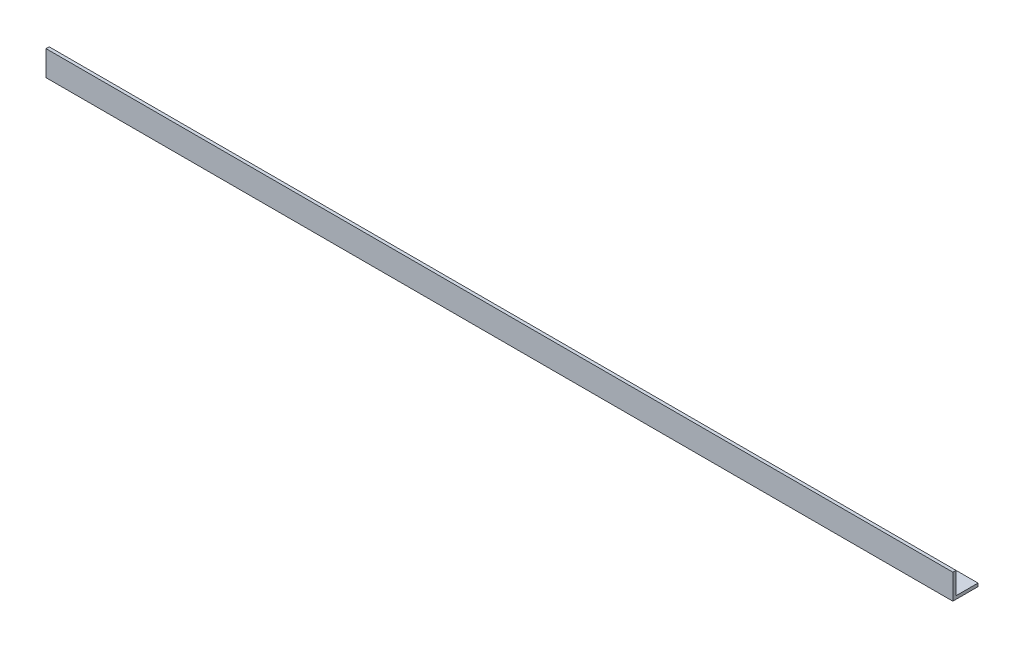
ISO-10303-21;
HEADER;
FILE_DESCRIPTION(('STEP AP214'),'2;1');
FILE_NAME('part.step','',(''),(''),'','','');
FILE_SCHEMA(('AUTOMOTIVE_DESIGN { 1 0 10303 214 1 1 1 1 }'));
ENDSEC;
DATA;
#1=APPLICATION_CONTEXT('core data for automotive mechanical design processes');
#2=APPLICATION_PROTOCOL_DEFINITION('international standard','automotive_design',2000,#1);
#3=PRODUCT_CONTEXT('',#1,'mechanical');
#4=PRODUCT('Part','Part','',(#3));
#5=PRODUCT_RELATED_PRODUCT_CATEGORY('part','',(#4));
#6=PRODUCT_DEFINITION_FORMATION('','',#4);
#7=PRODUCT_DEFINITION_CONTEXT('part definition',#1,'design');
#8=PRODUCT_DEFINITION('design','',#6,#7);
#9=PRODUCT_DEFINITION_SHAPE('','',#8);
#10=(LENGTH_UNIT() NAMED_UNIT(*) SI_UNIT(.MILLI.,.METRE.));
#11=(NAMED_UNIT(*) PLANE_ANGLE_UNIT() SI_UNIT($,.RADIAN.));
#12=(NAMED_UNIT(*) SI_UNIT($,.STERADIAN.) SOLID_ANGLE_UNIT());
#13=UNCERTAINTY_MEASURE_WITH_UNIT(LENGTH_MEASURE(1.E-05),#10,'distance_accuracy_value','');
#14=(GEOMETRIC_REPRESENTATION_CONTEXT(3) GLOBAL_UNCERTAINTY_ASSIGNED_CONTEXT((#13)) GLOBAL_UNIT_ASSIGNED_CONTEXT((#10,
#11,#12)) REPRESENTATION_CONTEXT('',''));
#15=CARTESIAN_POINT('',(0.,0.,0.));
#16=DIRECTION('',(0.,0.,1.));
#17=DIRECTION('',(1.,0.,0.));
#18=AXIS2_PLACEMENT_3D('',#15,#16,#17);
#19=CARTESIAN_POINT('',(457.2,0.,-25.4000000000001));
#20=DIRECTION('',(0.,1.,0.));
#21=DIRECTION('',(0.,0.,1.));
#22=AXIS2_PLACEMENT_3D('',#19,#20,#21);
#23=PLANE('',#22);
#24=DIRECTION('',(0.,0.,-1.));
#25=VECTOR('',#24,1.);
#26=CARTESIAN_POINT('',(-457.2,0.,-25.3999999999999));
#27=LINE('',#26,#25);
#28=CARTESIAN_POINT('',(-457.2,0.,0.));
#29=VERTEX_POINT('',#28);
#30=CARTESIAN_POINT('',(-457.2,0.,-25.3999999999999));
#31=VERTEX_POINT('',#30);
#32=EDGE_CURVE('E140',#29,#31,#27,.T.);
#33=ORIENTED_EDGE('',*,*,#32,.T.);
#34=DIRECTION('',(-1.,0.,0.));
#35=VECTOR('',#34,1.);
#36=CARTESIAN_POINT('',(457.2,0.,-25.4000000000001));
#37=LINE('',#36,#35);
#38=CARTESIAN_POINT('',(457.2,0.,-25.4000000000001));
#39=VERTEX_POINT('',#38);
#40=EDGE_CURVE('E11',#39,#31,#37,.T.);
#41=ORIENTED_EDGE('',*,*,#40,.F.);
#42=DIRECTION('',(0.,0.,-1.));
#43=VECTOR('',#42,1.);
#44=CARTESIAN_POINT('',(457.2,0.,-25.4000000000001));
#45=LINE('',#44,#43);
#46=CARTESIAN_POINT('',(457.2,0.,0.));
#47=VERTEX_POINT('',#46);
#48=EDGE_CURVE('E156',#47,#39,#45,.T.);
#49=ORIENTED_EDGE('',*,*,#48,.F.);
#50=DIRECTION('',(-1.,0.,0.));
#51=VECTOR('',#50,1.);
#52=CARTESIAN_POINT('',(457.2,0.,0.));
#53=LINE('',#52,#51);
#54=EDGE_CURVE('E136',#47,#29,#53,.T.);
#55=ORIENTED_EDGE('',*,*,#54,.T.);
#56=EDGE_LOOP('',(#33,#41,#49,#55));
#57=FACE_BOUND('',#56,.T.);
#58=ADVANCED_FACE('F44',(#57),#23,.F.);
#59=CARTESIAN_POINT('',(457.2,3.17500000000015,-25.4000000000001));
#60=DIRECTION('',(0.,0.,1.));
#61=DIRECTION('',(1.,0.,0.));
#62=AXIS2_PLACEMENT_3D('',#59,#60,#61);
#63=PLANE('',#62);
#64=DIRECTION('',(0.,1.,0.));
#65=VECTOR('',#64,1.);
#66=CARTESIAN_POINT('',(-457.2,3.17500000000015,-25.3999999999999));
#67=LINE('',#66,#65);
#68=CARTESIAN_POINT('',(-457.2,3.17500000000015,-25.3999999999999));
#69=VERTEX_POINT('',#68);
#70=EDGE_CURVE('E144',#31,#69,#67,.T.);
#71=ORIENTED_EDGE('',*,*,#70,.T.);
#72=DIRECTION('',(-1.,0.,0.));
#73=VECTOR('',#72,1.);
#74=CARTESIAN_POINT('',(457.2,3.17500000000015,-25.4000000000001));
#75=LINE('',#74,#73);
#76=CARTESIAN_POINT('',(457.2,3.17500000000015,-25.4000000000001));
#77=VERTEX_POINT('',#76);
#78=EDGE_CURVE('E53',#77,#69,#75,.T.);
#79=ORIENTED_EDGE('',*,*,#78,.F.);
#80=DIRECTION('',(0.,1.,0.));
#81=VECTOR('',#80,1.);
#82=CARTESIAN_POINT('',(457.2,3.17500000000015,-25.4000000000001));
#83=LINE('',#82,#81);
#84=EDGE_CURVE('E104',#39,#77,#83,.T.);
#85=ORIENTED_EDGE('',*,*,#84,.F.);
#86=ORIENTED_EDGE('',*,*,#40,.T.);
#87=EDGE_LOOP('',(#71,#79,#85,#86));
#88=FACE_BOUND('',#87,.T.);
#89=ADVANCED_FACE('F185',(#88),#63,.F.);
#90=CARTESIAN_POINT('',(457.200000000001,3.17500000000015,-3.17500000000015));
#91=DIRECTION('',(0.,-1.,0.));
#92=DIRECTION('',(0.,0.,-1.));
#93=AXIS2_PLACEMENT_3D('',#90,#91,#92);
#94=PLANE('',#93);
#95=DIRECTION('',(0.,0.,1.));
#96=VECTOR('',#95,1.);
#97=CARTESIAN_POINT('',(-457.199999999999,3.17500000000015,-3.17499999999993));
#98=LINE('',#97,#96);
#99=CARTESIAN_POINT('',(-457.199999999999,3.17500000000015,-3.17499999999993));
#100=VERTEX_POINT('',#99);
#101=EDGE_CURVE('E147',#69,#100,#98,.T.);
#102=ORIENTED_EDGE('',*,*,#101,.T.);
#103=DIRECTION('',(-1.,0.,0.));
#104=VECTOR('',#103,1.);
#105=CARTESIAN_POINT('',(457.200000000001,3.17500000000015,-3.17500000000015));
#106=LINE('',#105,#104);
#107=CARTESIAN_POINT('',(457.200000000001,3.17500000000015,-3.17500000000015));
#108=VERTEX_POINT('',#107);
#109=EDGE_CURVE('E128',#108,#100,#106,.T.);
#110=ORIENTED_EDGE('',*,*,#109,.F.);
#111=DIRECTION('',(0.,0.,1.));
#112=VECTOR('',#111,1.);
#113=CARTESIAN_POINT('',(457.200000000001,3.17500000000015,-3.17500000000015));
#114=LINE('',#113,#112);
#115=EDGE_CURVE('E117',#77,#108,#114,.T.);
#116=ORIENTED_EDGE('',*,*,#115,.F.);
#117=ORIENTED_EDGE('',*,*,#78,.T.);
#118=EDGE_LOOP('',(#102,#110,#116,#117));
#119=FACE_BOUND('',#118,.T.);
#120=ADVANCED_FACE('F167',(#119),#94,.F.);
#121=CARTESIAN_POINT('',(457.200000000001,25.3999999999999,-3.17500000000015));
#122=DIRECTION('',(0.,0.,1.));
#123=DIRECTION('',(0.,-1.,0.));
#124=AXIS2_PLACEMENT_3D('',#121,#122,#123);
#125=PLANE('',#124);
#126=DIRECTION('',(0.,1.,0.));
#127=VECTOR('',#126,1.);
#128=CARTESIAN_POINT('',(-457.199999999999,25.3999999999999,-3.17499999999993));
#129=LINE('',#128,#127);
#130=CARTESIAN_POINT('',(-457.199999999999,25.3999999999999,-3.17499999999993));
#131=VERTEX_POINT('',#130);
#132=EDGE_CURVE('E126',#100,#131,#129,.T.);
#133=ORIENTED_EDGE('',*,*,#132,.T.);
#134=DIRECTION('',(-1.,0.,0.));
#135=VECTOR('',#134,1.);
#136=CARTESIAN_POINT('',(457.200000000001,25.3999999999999,-3.17500000000015));
#137=LINE('',#136,#135);
#138=CARTESIAN_POINT('',(457.200000000001,25.3999999999999,-3.17500000000015));
#139=VERTEX_POINT('',#138);
#140=EDGE_CURVE('E123',#139,#131,#137,.T.);
#141=ORIENTED_EDGE('',*,*,#140,.F.);
#142=DIRECTION('',(0.,1.,0.));
#143=VECTOR('',#142,1.);
#144=CARTESIAN_POINT('',(457.200000000001,25.3999999999999,-3.17500000000015));
#145=LINE('',#144,#143);
#146=EDGE_CURVE('E111',#108,#139,#145,.T.);
#147=ORIENTED_EDGE('',*,*,#146,.F.);
#148=ORIENTED_EDGE('',*,*,#109,.T.);
#149=EDGE_LOOP('',(#133,#141,#147,#148));
#150=FACE_BOUND('',#149,.T.);
#151=ADVANCED_FACE('F124',(#150),#125,.F.);
#152=CARTESIAN_POINT('',(457.2,25.3999999999999,0.));
#153=DIRECTION('',(0.,-1.,0.));
#154=DIRECTION('',(0.,0.,-1.));
#155=AXIS2_PLACEMENT_3D('',#152,#153,#154);
#156=PLANE('',#155);
#157=DIRECTION('',(0.,0.,1.));
#158=VECTOR('',#157,1.);
#159=CARTESIAN_POINT('',(-457.2,25.3999999999999,0.));
#160=LINE('',#159,#158);
#161=CARTESIAN_POINT('',(-457.2,25.3999999999999,0.));
#162=VERTEX_POINT('',#161);
#163=EDGE_CURVE('E89',#131,#162,#160,.T.);
#164=ORIENTED_EDGE('',*,*,#163,.T.);
#165=DIRECTION('',(-1.,0.,0.));
#166=VECTOR('',#165,1.);
#167=CARTESIAN_POINT('',(457.2,25.3999999999999,0.));
#168=LINE('',#167,#166);
#169=CARTESIAN_POINT('',(457.2,25.3999999999999,0.));
#170=VERTEX_POINT('',#169);
#171=EDGE_CURVE('E129',#170,#162,#168,.T.);
#172=ORIENTED_EDGE('',*,*,#171,.F.);
#173=DIRECTION('',(0.,0.,1.));
#174=VECTOR('',#173,1.);
#175=CARTESIAN_POINT('',(457.2,25.3999999999999,0.));
#176=LINE('',#175,#174);
#177=EDGE_CURVE('E115',#139,#170,#176,.T.);
#178=ORIENTED_EDGE('',*,*,#177,.F.);
#179=ORIENTED_EDGE('',*,*,#140,.T.);
#180=EDGE_LOOP('',(#164,#172,#178,#179));
#181=FACE_BOUND('',#180,.T.);
#182=ADVANCED_FACE('F131',(#181),#156,.F.);
#183=CARTESIAN_POINT('',(457.2,0.,0.));
#184=DIRECTION('',(0.,0.,-1.));
#185=DIRECTION('',(-1.,0.,0.));
#186=AXIS2_PLACEMENT_3D('',#183,#184,#185);
#187=PLANE('',#186);
#188=DIRECTION('',(0.,-1.,0.));
#189=VECTOR('',#188,1.);
#190=CARTESIAN_POINT('',(-457.2,0.,0.));
#191=LINE('',#190,#189);
#192=EDGE_CURVE('E96',#162,#29,#191,.T.);
#193=ORIENTED_EDGE('',*,*,#192,.T.);
#194=ORIENTED_EDGE('',*,*,#54,.F.);
#195=DIRECTION('',(0.,-1.,0.));
#196=VECTOR('',#195,1.);
#197=CARTESIAN_POINT('',(457.2,0.,0.));
#198=LINE('',#197,#196);
#199=EDGE_CURVE('E61',#170,#47,#198,.T.);
#200=ORIENTED_EDGE('',*,*,#199,.F.);
#201=ORIENTED_EDGE('',*,*,#171,.T.);
#202=EDGE_LOOP('',(#193,#194,#200,#201));
#203=FACE_BOUND('',#202,.T.);
#204=ADVANCED_FACE('F174',(#203),#187,.F.);
#205=CARTESIAN_POINT('',(457.2,0.,0.));
#206=DIRECTION('',(-1.,0.,0.));
#207=DIRECTION('',(0.,0.,1.));
#208=AXIS2_PLACEMENT_3D('',#205,#206,#207);
#209=PLANE('',#208);
#210=ORIENTED_EDGE('',*,*,#48,.T.);
#211=ORIENTED_EDGE('',*,*,#84,.T.);
#212=ORIENTED_EDGE('',*,*,#115,.T.);
#213=ORIENTED_EDGE('',*,*,#146,.T.);
#214=ORIENTED_EDGE('',*,*,#177,.T.);
#215=ORIENTED_EDGE('',*,*,#199,.T.);
#216=EDGE_LOOP('',(#210,#211,#212,#213,#214,#215));
#217=FACE_BOUND('',#216,.T.);
#218=ADVANCED_FACE('F113',(#217),#209,.F.);
#219=CARTESIAN_POINT('',(-457.2,0.,0.));
#220=DIRECTION('',(-1.,0.,0.));
#221=DIRECTION('',(0.,0.,1.));
#222=AXIS2_PLACEMENT_3D('',#219,#220,#221);
#223=PLANE('',#222);
#224=ORIENTED_EDGE('',*,*,#32,.F.);
#225=ORIENTED_EDGE('',*,*,#192,.F.);
#226=ORIENTED_EDGE('',*,*,#163,.F.);
#227=ORIENTED_EDGE('',*,*,#132,.F.);
#228=ORIENTED_EDGE('',*,*,#101,.F.);
#229=ORIENTED_EDGE('',*,*,#70,.F.);
#230=EDGE_LOOP('',(#224,#225,#226,#227,#228,#229));
#231=FACE_BOUND('',#230,.T.);
#232=ADVANCED_FACE('F170',(#231),#223,.T.);
#233=CLOSED_SHELL('',(#58,#89,#120,#151,#182,#204,#218,#232));
#234=MANIFOLD_SOLID_BREP('B2',#233);
#235=ADVANCED_BREP_SHAPE_REPRESENTATION('',(#18,#234),#14);
#236=SHAPE_DEFINITION_REPRESENTATION(#9,#235);
ENDSEC;
END-ISO-10303-21;
